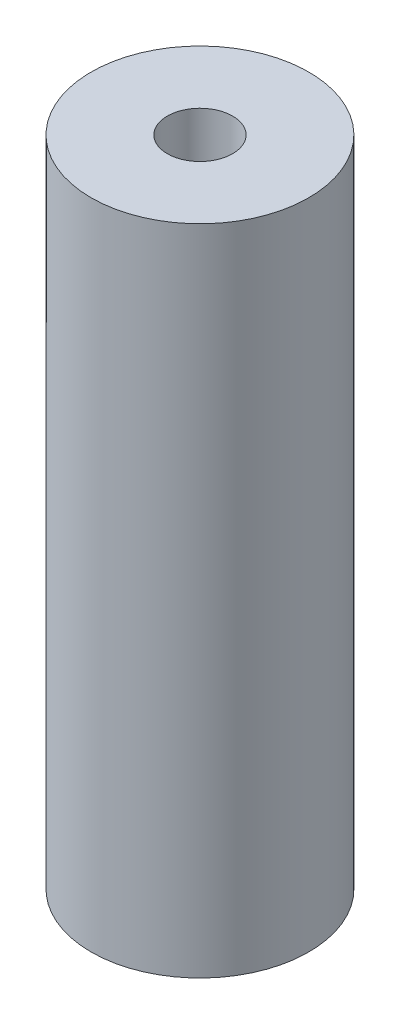
ISO-10303-21;
HEADER;
FILE_DESCRIPTION(('STEP AP214'),'2;1');
FILE_NAME('part.step','',(''),(''),'','','');
FILE_SCHEMA(('AUTOMOTIVE_DESIGN { 1 0 10303 214 1 1 1 1 }'));
ENDSEC;
DATA;
#1=APPLICATION_CONTEXT('core data for automotive mechanical design processes');
#2=APPLICATION_PROTOCOL_DEFINITION('international standard','automotive_design',2000,#1);
#3=PRODUCT_CONTEXT('',#1,'mechanical');
#4=PRODUCT('Part','Part','',(#3));
#5=PRODUCT_RELATED_PRODUCT_CATEGORY('part','',(#4));
#6=PRODUCT_DEFINITION_FORMATION('','',#4);
#7=PRODUCT_DEFINITION_CONTEXT('part definition',#1,'design');
#8=PRODUCT_DEFINITION('design','',#6,#7);
#9=PRODUCT_DEFINITION_SHAPE('','',#8);
#10=(LENGTH_UNIT() NAMED_UNIT(*) SI_UNIT(.MILLI.,.METRE.));
#11=(NAMED_UNIT(*) PLANE_ANGLE_UNIT() SI_UNIT($,.RADIAN.));
#12=(NAMED_UNIT(*) SI_UNIT($,.STERADIAN.) SOLID_ANGLE_UNIT());
#13=UNCERTAINTY_MEASURE_WITH_UNIT(LENGTH_MEASURE(1.E-05),#10,'distance_accuracy_value','');
#14=(GEOMETRIC_REPRESENTATION_CONTEXT(3) GLOBAL_UNCERTAINTY_ASSIGNED_CONTEXT((#13)) GLOBAL_UNIT_ASSIGNED_CONTEXT((#10,
#11,#12)) REPRESENTATION_CONTEXT('',''));
#15=CARTESIAN_POINT('',(0.,0.,0.));
#16=DIRECTION('',(0.,0.,1.));
#17=DIRECTION('',(1.,0.,0.));
#18=AXIS2_PLACEMENT_3D('',#15,#16,#17);
#19=CARTESIAN_POINT('',(0.,30.,0.));
#20=DIRECTION('',(0.,-1.,0.));
#21=DIRECTION('',(0.,0.,-1.));
#22=AXIS2_PLACEMENT_3D('',#19,#20,#21);
#23=CYLINDRICAL_SURFACE('',#22,5.);
#24=CARTESIAN_POINT('',(0.,30.,0.));
#25=DIRECTION('',(0.,1.,0.));
#26=DIRECTION('',(0.,0.,1.));
#27=AXIS2_PLACEMENT_3D('',#24,#25,#26);
#28=CIRCLE('',#27,5.);
#29=CARTESIAN_POINT('',(0.,30.,5.));
#30=VERTEX_POINT('',#29);
#31=EDGE_CURVE('E10',#30,#30,#28,.T.);
#32=ORIENTED_EDGE('',*,*,#31,.F.);
#33=EDGE_LOOP('',(#32));
#34=FACE_BOUND('',#33,.T.);
#35=CARTESIAN_POINT('',(0.,0.,0.));
#36=DIRECTION('',(0.,1.,0.));
#37=DIRECTION('',(0.,0.,1.));
#38=AXIS2_PLACEMENT_3D('',#35,#36,#37);
#39=CIRCLE('',#38,5.);
#40=CARTESIAN_POINT('',(0.,0.,5.));
#41=VERTEX_POINT('',#40);
#42=EDGE_CURVE('E33',#41,#41,#39,.T.);
#43=ORIENTED_EDGE('',*,*,#42,.T.);
#44=EDGE_LOOP('',(#43));
#45=FACE_BOUND('',#44,.T.);
#46=ADVANCED_FACE('F30',(#34,#45),#23,.T.);
#47=CARTESIAN_POINT('',(0.,30.,0.));
#48=DIRECTION('',(0.,1.,0.));
#49=DIRECTION('',(0.,0.,1.));
#50=AXIS2_PLACEMENT_3D('',#47,#48,#49);
#51=PLANE('',#50);
#52=CARTESIAN_POINT('',(0.,30.,0.));
#53=DIRECTION('',(0.,1.,0.));
#54=DIRECTION('',(0.,0.,1.));
#55=AXIS2_PLACEMENT_3D('',#52,#53,#54);
#56=CIRCLE('',#55,1.5);
#57=CARTESIAN_POINT('',(0.,30.,1.5));
#58=VERTEX_POINT('',#57);
#59=EDGE_CURVE('E42',#58,#58,#56,.T.);
#60=ORIENTED_EDGE('',*,*,#59,.F.);
#61=EDGE_LOOP('',(#60));
#62=FACE_BOUND('',#61,.T.);
#63=ORIENTED_EDGE('',*,*,#31,.T.);
#64=EDGE_LOOP('',(#63));
#65=FACE_BOUND('',#64,.T.);
#66=ADVANCED_FACE('F67',(#62,#65),#51,.T.);
#67=CARTESIAN_POINT('',(0.,0.,0.));
#68=DIRECTION('',(0.,1.,0.));
#69=DIRECTION('',(0.,0.,1.));
#70=AXIS2_PLACEMENT_3D('',#67,#68,#69);
#71=PLANE('',#70);
#72=CARTESIAN_POINT('',(0.,0.,0.));
#73=DIRECTION('',(0.,-1.,0.));
#74=DIRECTION('',(0.,0.,-1.));
#75=AXIS2_PLACEMENT_3D('',#72,#73,#74);
#76=CIRCLE('',#75,1.5);
#77=CARTESIAN_POINT('',(0.,0.,-1.5));
#78=VERTEX_POINT('',#77);
#79=EDGE_CURVE('E48',#78,#78,#76,.T.);
#80=ORIENTED_EDGE('',*,*,#79,.F.);
#81=EDGE_LOOP('',(#80));
#82=FACE_BOUND('',#81,.T.);
#83=ORIENTED_EDGE('',*,*,#42,.F.);
#84=EDGE_LOOP('',(#83));
#85=FACE_BOUND('',#84,.T.);
#86=ADVANCED_FACE('F63',(#82,#85),#71,.F.);
#87=CARTESIAN_POINT('',(0.,25.,0.));
#88=DIRECTION('',(0.,1.,0.));
#89=DIRECTION('',(0.,0.,1.));
#90=AXIS2_PLACEMENT_3D('',#87,#88,#89);
#91=CYLINDRICAL_SURFACE('',#90,1.5);
#92=CARTESIAN_POINT('',(0.,25.,0.));
#93=DIRECTION('',(0.,1.,0.));
#94=DIRECTION('',(0.,0.,1.));
#95=AXIS2_PLACEMENT_3D('',#92,#93,#94);
#96=CIRCLE('',#95,1.5);
#97=CARTESIAN_POINT('',(0.,25.,1.5));
#98=VERTEX_POINT('',#97);
#99=EDGE_CURVE('E40',#98,#98,#96,.T.);
#100=ORIENTED_EDGE('',*,*,#99,.F.);
#101=EDGE_LOOP('',(#100));
#102=FACE_BOUND('',#101,.T.);
#103=ORIENTED_EDGE('',*,*,#59,.T.);
#104=EDGE_LOOP('',(#103));
#105=FACE_BOUND('',#104,.T.);
#106=ADVANCED_FACE('F66',(#102,#105),#91,.F.);
#107=CARTESIAN_POINT('',(0.,25.,0.));
#108=DIRECTION('',(0.,1.,0.));
#109=DIRECTION('',(0.,0.,1.));
#110=AXIS2_PLACEMENT_3D('',#107,#108,#109);
#111=PLANE('',#110);
#112=ORIENTED_EDGE('',*,*,#99,.T.);
#113=EDGE_LOOP('',(#112));
#114=FACE_BOUND('',#113,.T.);
#115=ADVANCED_FACE('F59',(#114),#111,.T.);
#116=CARTESIAN_POINT('',(0.,5.,0.));
#117=DIRECTION('',(0.,-1.,0.));
#118=DIRECTION('',(0.,0.,-1.));
#119=AXIS2_PLACEMENT_3D('',#116,#117,#118);
#120=CYLINDRICAL_SURFACE('',#119,1.5);
#121=CARTESIAN_POINT('',(0.,5.,0.));
#122=DIRECTION('',(0.,-1.,0.));
#123=DIRECTION('',(0.,0.,-1.));
#124=AXIS2_PLACEMENT_3D('',#121,#122,#123);
#125=CIRCLE('',#124,1.5);
#126=CARTESIAN_POINT('',(0.,5.,-1.5));
#127=VERTEX_POINT('',#126);
#128=EDGE_CURVE('E45',#127,#127,#125,.T.);
#129=ORIENTED_EDGE('',*,*,#128,.F.);
#130=EDGE_LOOP('',(#129));
#131=FACE_BOUND('',#130,.T.);
#132=ORIENTED_EDGE('',*,*,#79,.T.);
#133=EDGE_LOOP('',(#132));
#134=FACE_BOUND('',#133,.T.);
#135=ADVANCED_FACE('F56',(#131,#134),#120,.F.);
#136=CARTESIAN_POINT('',(0.,5.,0.));
#137=DIRECTION('',(0.,-1.,0.));
#138=DIRECTION('',(0.,0.,-1.));
#139=AXIS2_PLACEMENT_3D('',#136,#137,#138);
#140=PLANE('',#139);
#141=ORIENTED_EDGE('',*,*,#128,.T.);
#142=EDGE_LOOP('',(#141));
#143=FACE_BOUND('',#142,.T.);
#144=ADVANCED_FACE('F54',(#143),#140,.T.);
#145=CLOSED_SHELL('',(#46,#66,#86,#106,#115,#135,#144));
#146=MANIFOLD_SOLID_BREP('B2',#145);
#147=ADVANCED_BREP_SHAPE_REPRESENTATION('',(#18,#146),#14);
#148=SHAPE_DEFINITION_REPRESENTATION(#9,#147);
ENDSEC;
END-ISO-10303-21;
